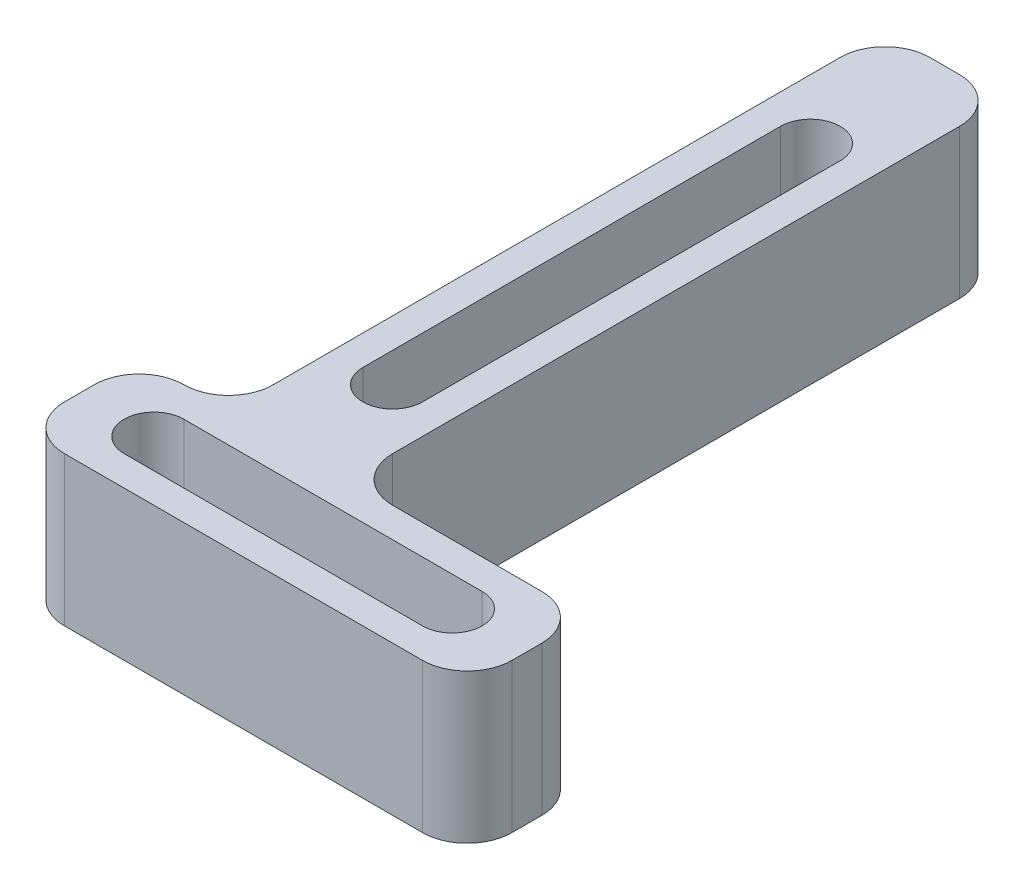
ISO-10303-21;
HEADER;
FILE_DESCRIPTION(('STEP AP214'),'2;1');
FILE_NAME('part.step','',(''),(''),'','','');
FILE_SCHEMA(('AUTOMOTIVE_DESIGN { 1 0 10303 214 1 1 1 1 }'));
ENDSEC;
DATA;
#1=APPLICATION_CONTEXT('core data for automotive mechanical design processes');
#2=APPLICATION_PROTOCOL_DEFINITION('international standard','automotive_design',2000,#1);
#3=PRODUCT_CONTEXT('',#1,'mechanical');
#4=PRODUCT('Part','Part','',(#3));
#5=PRODUCT_RELATED_PRODUCT_CATEGORY('part','',(#4));
#6=PRODUCT_DEFINITION_FORMATION('','',#4);
#7=PRODUCT_DEFINITION_CONTEXT('part definition',#1,'design');
#8=PRODUCT_DEFINITION('design','',#6,#7);
#9=PRODUCT_DEFINITION_SHAPE('','',#8);
#10=(LENGTH_UNIT() NAMED_UNIT(*) SI_UNIT(.MILLI.,.METRE.));
#11=(NAMED_UNIT(*) PLANE_ANGLE_UNIT() SI_UNIT($,.RADIAN.));
#12=(NAMED_UNIT(*) SI_UNIT($,.STERADIAN.) SOLID_ANGLE_UNIT());
#13=UNCERTAINTY_MEASURE_WITH_UNIT(LENGTH_MEASURE(1.E-05),#10,'distance_accuracy_value','');
#14=(GEOMETRIC_REPRESENTATION_CONTEXT(3) GLOBAL_UNCERTAINTY_ASSIGNED_CONTEXT((#13)) GLOBAL_UNIT_ASSIGNED_CONTEXT((#10,
#11,#12)) REPRESENTATION_CONTEXT('',''));
#15=CARTESIAN_POINT('',(0.,0.,0.));
#16=DIRECTION('',(0.,0.,1.));
#17=DIRECTION('',(1.,0.,0.));
#18=AXIS2_PLACEMENT_3D('',#15,#16,#17);
#19=CARTESIAN_POINT('',(-8.,20.,44.));
#20=DIRECTION('',(1.,0.,0.));
#21=DIRECTION('',(0.,0.,-1.));
#22=AXIS2_PLACEMENT_3D('',#19,#20,#21);
#23=PLANE('',#22);
#24=DIRECTION('',(0.,0.,1.));
#25=VECTOR('',#24,1.);
#26=CARTESIAN_POINT('',(-8.,20.,44.));
#27=LINE('',#26,#25);
#28=CARTESIAN_POINT('',(-8.,20.,-38.));
#29=VERTEX_POINT('',#28);
#30=CARTESIAN_POINT('',(-8.,20.,38.));
#31=VERTEX_POINT('',#30);
#32=EDGE_CURVE('E271',#29,#31,#27,.T.);
#33=ORIENTED_EDGE('',*,*,#32,.T.);
#34=DIRECTION('',(0.,1.,0.));
#35=VECTOR('',#34,1.);
#36=CARTESIAN_POINT('',(-8.,20.,38.));
#37=LINE('',#36,#35);
#38=CARTESIAN_POINT('',(-8.,40.,38.));
#39=VERTEX_POINT('',#38);
#40=EDGE_CURVE('E385',#39,#31,#37,.F.);
#41=ORIENTED_EDGE('',*,*,#40,.F.);
#42=DIRECTION('',(0.,0.,1.));
#43=VECTOR('',#42,1.);
#44=CARTESIAN_POINT('',(-8.,40.,44.));
#45=LINE('',#44,#43);
#46=CARTESIAN_POINT('',(-8.,40.,-38.));
#47=VERTEX_POINT('',#46);
#48=EDGE_CURVE('E267',#47,#39,#45,.T.);
#49=ORIENTED_EDGE('',*,*,#48,.F.);
#50=DIRECTION('',(0.,1.,0.));
#51=VECTOR('',#50,1.);
#52=CARTESIAN_POINT('',(-8.,20.,-38.));
#53=LINE('',#52,#51);
#54=EDGE_CURVE('E388',#29,#47,#53,.T.);
#55=ORIENTED_EDGE('',*,*,#54,.F.);
#56=EDGE_LOOP('',(#33,#41,#49,#55));
#57=FACE_BOUND('',#56,.T.);
#58=ADVANCED_FACE('F39',(#57),#23,.F.);
#59=CARTESIAN_POINT('',(-20.,20.,60.));
#60=DIRECTION('',(1.,0.,0.));
#61=DIRECTION('',(0.,0.,-1.));
#62=AXIS2_PLACEMENT_3D('',#59,#60,#61);
#63=PLANE('',#62);
#64=DIRECTION('',(0.,0.,1.));
#65=VECTOR('',#64,1.);
#66=CARTESIAN_POINT('',(-20.,40.,60.));
#67=LINE('',#66,#65);
#68=CARTESIAN_POINT('',(-20.,40.,50.));
#69=VERTEX_POINT('',#68);
#70=CARTESIAN_POINT('',(-20.,40.,54.));
#71=VERTEX_POINT('',#70);
#72=EDGE_CURVE('E296',#69,#71,#67,.T.);
#73=ORIENTED_EDGE('',*,*,#72,.F.);
#74=DIRECTION('',(0.,1.,0.));
#75=VECTOR('',#74,1.);
#76=CARTESIAN_POINT('',(-20.,20.,50.));
#77=LINE('',#76,#75);
#78=CARTESIAN_POINT('',(-20.,20.,50.));
#79=VERTEX_POINT('',#78);
#80=EDGE_CURVE('E361',#79,#69,#77,.T.);
#81=ORIENTED_EDGE('',*,*,#80,.F.);
#82=DIRECTION('',(0.,0.,1.));
#83=VECTOR('',#82,1.);
#84=CARTESIAN_POINT('',(-20.,20.,60.));
#85=LINE('',#84,#83);
#86=CARTESIAN_POINT('',(-20.,20.,54.));
#87=VERTEX_POINT('',#86);
#88=EDGE_CURVE('E274',#79,#87,#85,.T.);
#89=ORIENTED_EDGE('',*,*,#88,.T.);
#90=DIRECTION('',(0.,1.,0.));
#91=VECTOR('',#90,1.);
#92=CARTESIAN_POINT('',(-20.,20.,54.));
#93=LINE('',#92,#91);
#94=EDGE_CURVE('E364',#71,#87,#93,.F.);
#95=ORIENTED_EDGE('',*,*,#94,.F.);
#96=EDGE_LOOP('',(#73,#81,#89,#95));
#97=FACE_BOUND('',#96,.T.);
#98=ADVANCED_FACE('F415',(#97),#63,.F.);
#99=CARTESIAN_POINT('',(40.,20.,60.));
#100=DIRECTION('',(0.,0.,-1.));
#101=DIRECTION('',(-1.,0.,0.));
#102=AXIS2_PLACEMENT_3D('',#99,#100,#101);
#103=PLANE('',#102);
#104=DIRECTION('',(1.,0.,0.));
#105=VECTOR('',#104,1.);
#106=CARTESIAN_POINT('',(40.,40.,60.));
#107=LINE('',#106,#105);
#108=CARTESIAN_POINT('',(-14.,40.,60.));
#109=VERTEX_POINT('',#108);
#110=CARTESIAN_POINT('',(34.,40.,60.));
#111=VERTEX_POINT('',#110);
#112=EDGE_CURVE('E299',#109,#111,#107,.T.);
#113=ORIENTED_EDGE('',*,*,#112,.F.);
#114=DIRECTION('',(0.,1.,0.));
#115=VECTOR('',#114,1.);
#116=CARTESIAN_POINT('',(-14.,20.,60.));
#117=LINE('',#116,#115);
#118=CARTESIAN_POINT('',(-14.,20.,60.));
#119=VERTEX_POINT('',#118);
#120=EDGE_CURVE('E343',#119,#109,#117,.T.);
#121=ORIENTED_EDGE('',*,*,#120,.F.);
#122=DIRECTION('',(1.,0.,0.));
#123=VECTOR('',#122,1.);
#124=CARTESIAN_POINT('',(40.,20.,60.));
#125=LINE('',#124,#123);
#126=CARTESIAN_POINT('',(34.,20.,60.));
#127=VERTEX_POINT('',#126);
#128=EDGE_CURVE('E278',#119,#127,#125,.T.);
#129=ORIENTED_EDGE('',*,*,#128,.T.);
#130=DIRECTION('',(0.,1.,0.));
#131=VECTOR('',#130,1.);
#132=CARTESIAN_POINT('',(34.,20.,60.));
#133=LINE('',#132,#131);
#134=EDGE_CURVE('E346',#111,#127,#133,.F.);
#135=ORIENTED_EDGE('',*,*,#134,.F.);
#136=EDGE_LOOP('',(#113,#121,#129,#135));
#137=FACE_BOUND('',#136,.T.);
#138=ADVANCED_FACE('F422',(#137),#103,.F.);
#139=CARTESIAN_POINT('',(40.,20.,44.));
#140=DIRECTION('',(-1.,0.,0.));
#141=DIRECTION('',(0.,0.,1.));
#142=AXIS2_PLACEMENT_3D('',#139,#140,#141);
#143=PLANE('',#142);
#144=DIRECTION('',(0.,0.,-1.));
#145=VECTOR('',#144,1.);
#146=CARTESIAN_POINT('',(40.,20.,44.));
#147=LINE('',#146,#145);
#148=CARTESIAN_POINT('',(40.,20.,54.));
#149=VERTEX_POINT('',#148);
#150=CARTESIAN_POINT('',(40.,20.,50.));
#151=VERTEX_POINT('',#150);
#152=EDGE_CURVE('E281',#149,#151,#147,.T.);
#153=ORIENTED_EDGE('',*,*,#152,.T.);
#154=DIRECTION('',(0.,1.,0.));
#155=VECTOR('',#154,1.);
#156=CARTESIAN_POINT('',(40.,20.,50.));
#157=LINE('',#156,#155);
#158=CARTESIAN_POINT('',(40.,40.,50.));
#159=VERTEX_POINT('',#158);
#160=EDGE_CURVE('E324',#159,#151,#157,.F.);
#161=ORIENTED_EDGE('',*,*,#160,.F.);
#162=DIRECTION('',(0.,0.,-1.));
#163=VECTOR('',#162,1.);
#164=CARTESIAN_POINT('',(40.,40.,44.));
#165=LINE('',#164,#163);
#166=CARTESIAN_POINT('',(40.,40.,54.));
#167=VERTEX_POINT('',#166);
#168=EDGE_CURVE('E302',#167,#159,#165,.T.);
#169=ORIENTED_EDGE('',*,*,#168,.F.);
#170=DIRECTION('',(0.,1.,0.));
#171=VECTOR('',#170,1.);
#172=CARTESIAN_POINT('',(40.,20.,54.));
#173=LINE('',#172,#171);
#174=EDGE_CURVE('E327',#149,#167,#173,.T.);
#175=ORIENTED_EDGE('',*,*,#174,.F.);
#176=EDGE_LOOP('',(#153,#161,#169,#175));
#177=FACE_BOUND('',#176,.T.);
#178=ADVANCED_FACE('F430',(#177),#143,.F.);
#179=CARTESIAN_POINT('',(8.,20.,44.));
#180=DIRECTION('',(0.,0.,1.));
#181=DIRECTION('',(1.,0.,0.));
#182=AXIS2_PLACEMENT_3D('',#179,#180,#181);
#183=PLANE('',#182);
#184=DIRECTION('',(-1.,0.,0.));
#185=VECTOR('',#184,1.);
#186=CARTESIAN_POINT('',(8.,20.,44.));
#187=LINE('',#186,#185);
#188=CARTESIAN_POINT('',(34.,20.,44.));
#189=VERTEX_POINT('',#188);
#190=CARTESIAN_POINT('',(14.,20.,44.));
#191=VERTEX_POINT('',#190);
#192=EDGE_CURVE('E284',#189,#191,#187,.T.);
#193=ORIENTED_EDGE('',*,*,#192,.T.);
#194=DIRECTION('',(0.,1.,0.));
#195=VECTOR('',#194,1.);
#196=CARTESIAN_POINT('',(14.,20.,44.));
#197=LINE('',#196,#195);
#198=CARTESIAN_POINT('',(14.,40.,44.));
#199=VERTEX_POINT('',#198);
#200=EDGE_CURVE('E367',#199,#191,#197,.F.);
#201=ORIENTED_EDGE('',*,*,#200,.F.);
#202=DIRECTION('',(-1.,0.,0.));
#203=VECTOR('',#202,1.);
#204=CARTESIAN_POINT('',(8.,40.,44.));
#205=LINE('',#204,#203);
#206=CARTESIAN_POINT('',(34.,40.,44.));
#207=VERTEX_POINT('',#206);
#208=EDGE_CURVE('E305',#207,#199,#205,.T.);
#209=ORIENTED_EDGE('',*,*,#208,.F.);
#210=DIRECTION('',(0.,1.,0.));
#211=VECTOR('',#210,1.);
#212=CARTESIAN_POINT('',(34.,20.,44.));
#213=LINE('',#212,#211);
#214=EDGE_CURVE('E370',#189,#207,#213,.T.);
#215=ORIENTED_EDGE('',*,*,#214,.F.);
#216=EDGE_LOOP('',(#193,#201,#209,#215));
#217=FACE_BOUND('',#216,.T.);
#218=ADVANCED_FACE('F437',(#217),#183,.F.);
#219=CARTESIAN_POINT('',(8.,20.,-44.));
#220=DIRECTION('',(-1.,0.,0.));
#221=DIRECTION('',(0.,0.,1.));
#222=AXIS2_PLACEMENT_3D('',#219,#220,#221);
#223=PLANE('',#222);
#224=DIRECTION('',(0.,0.,-1.));
#225=VECTOR('',#224,1.);
#226=CARTESIAN_POINT('',(8.,20.,-44.));
#227=LINE('',#226,#225);
#228=CARTESIAN_POINT('',(8.,20.,38.));
#229=VERTEX_POINT('',#228);
#230=CARTESIAN_POINT('',(8.,20.,-38.));
#231=VERTEX_POINT('',#230);
#232=EDGE_CURVE('E287',#229,#231,#227,.T.);
#233=ORIENTED_EDGE('',*,*,#232,.T.);
#234=DIRECTION('',(0.,1.,0.));
#235=VECTOR('',#234,1.);
#236=CARTESIAN_POINT('',(8.,20.,-38.));
#237=LINE('',#236,#235);
#238=CARTESIAN_POINT('',(8.,40.,-38.));
#239=VERTEX_POINT('',#238);
#240=EDGE_CURVE('E373',#239,#231,#237,.F.);
#241=ORIENTED_EDGE('',*,*,#240,.F.);
#242=DIRECTION('',(0.,0.,-1.));
#243=VECTOR('',#242,1.);
#244=CARTESIAN_POINT('',(8.,40.,-44.));
#245=LINE('',#244,#243);
#246=CARTESIAN_POINT('',(8.,40.,38.));
#247=VERTEX_POINT('',#246);
#248=EDGE_CURVE('E308',#247,#239,#245,.T.);
#249=ORIENTED_EDGE('',*,*,#248,.F.);
#250=DIRECTION('',(0.,1.,0.));
#251=VECTOR('',#250,1.);
#252=CARTESIAN_POINT('',(8.,40.,38.));
#253=LINE('',#252,#251);
#254=EDGE_CURVE('E376',#229,#247,#253,.T.);
#255=ORIENTED_EDGE('',*,*,#254,.F.);
#256=EDGE_LOOP('',(#233,#241,#249,#255));
#257=FACE_BOUND('',#256,.T.);
#258=ADVANCED_FACE('F446',(#257),#223,.F.);
#259=CARTESIAN_POINT('',(-8.,20.,-44.));
#260=DIRECTION('',(0.,0.,1.));
#261=DIRECTION('',(1.,0.,0.));
#262=AXIS2_PLACEMENT_3D('',#259,#260,#261);
#263=PLANE('',#262);
#264=DIRECTION('',(-1.,0.,0.));
#265=VECTOR('',#264,1.);
#266=CARTESIAN_POINT('',(-8.,20.,-44.));
#267=LINE('',#266,#265);
#268=CARTESIAN_POINT('',(1.99999999999999,20.,-44.));
#269=VERTEX_POINT('',#268);
#270=CARTESIAN_POINT('',(-2.00000000000001,20.,-44.));
#271=VERTEX_POINT('',#270);
#272=EDGE_CURVE('E290',#269,#271,#267,.T.);
#273=ORIENTED_EDGE('',*,*,#272,.T.);
#274=DIRECTION('',(0.,1.,0.));
#275=VECTOR('',#274,1.);
#276=CARTESIAN_POINT('',(-2.00000000000001,20.,-44.));
#277=LINE('',#276,#275);
#278=CARTESIAN_POINT('',(-2.00000000000001,40.,-44.));
#279=VERTEX_POINT('',#278);
#280=EDGE_CURVE('E379',#279,#271,#277,.F.);
#281=ORIENTED_EDGE('',*,*,#280,.F.);
#282=DIRECTION('',(-1.,0.,0.));
#283=VECTOR('',#282,1.);
#284=CARTESIAN_POINT('',(-8.,40.,-44.));
#285=LINE('',#284,#283);
#286=CARTESIAN_POINT('',(1.99999999999999,40.,-44.));
#287=VERTEX_POINT('',#286);
#288=EDGE_CURVE('E275',#287,#279,#285,.T.);
#289=ORIENTED_EDGE('',*,*,#288,.F.);
#290=DIRECTION('',(0.,1.,0.));
#291=VECTOR('',#290,1.);
#292=CARTESIAN_POINT('',(1.99999999999999,20.,-44.));
#293=LINE('',#292,#291);
#294=EDGE_CURVE('E382',#269,#287,#293,.T.);
#295=ORIENTED_EDGE('',*,*,#294,.F.);
#296=EDGE_LOOP('',(#273,#281,#289,#295));
#297=FACE_BOUND('',#296,.T.);
#298=ADVANCED_FACE('F453',(#297),#263,.F.);
#299=CARTESIAN_POINT('',(0.,20.,0.));
#300=DIRECTION('',(0.,1.,0.));
#301=DIRECTION('',(0.,0.,-1.));
#302=AXIS2_PLACEMENT_3D('',#299,#300,#301);
#303=PLANE('',#302);
#304=DIRECTION('',(1.,0.,0.));
#305=VECTOR('',#304,1.);
#306=CARTESIAN_POINT('',(-10.,20.,56.));
#307=LINE('',#306,#305);
#308=CARTESIAN_POINT('',(-10.,20.,56.));
#309=VERTEX_POINT('',#308);
#310=CARTESIAN_POINT('',(30.,20.,56.));
#311=VERTEX_POINT('',#310);
#312=EDGE_CURVE('E201',#309,#311,#307,.T.);
#313=ORIENTED_EDGE('',*,*,#312,.T.);
#314=CARTESIAN_POINT('',(30.,20.,52.));
#315=DIRECTION('',(0.,1.,0.));
#316=DIRECTION('',(0.,0.,1.));
#317=AXIS2_PLACEMENT_3D('',#314,#315,#316);
#318=CIRCLE('',#317,3.99999999999999);
#319=CARTESIAN_POINT('',(30.,20.,48.));
#320=VERTEX_POINT('',#319);
#321=EDGE_CURVE('E218',#311,#320,#318,.T.);
#322=ORIENTED_EDGE('',*,*,#321,.T.);
#323=DIRECTION('',(-1.,0.,0.));
#324=VECTOR('',#323,1.);
#325=CARTESIAN_POINT('',(-10.,20.,48.));
#326=LINE('',#325,#324);
#327=CARTESIAN_POINT('',(-10.,20.,48.));
#328=VERTEX_POINT('',#327);
#329=EDGE_CURVE('E215',#320,#328,#326,.T.);
#330=ORIENTED_EDGE('',*,*,#329,.T.);
#331=CARTESIAN_POINT('',(-10.,20.,52.));
#332=DIRECTION('',(0.,1.,0.));
#333=DIRECTION('',(0.,0.,1.));
#334=AXIS2_PLACEMENT_3D('',#331,#332,#333);
#335=CIRCLE('',#334,3.99999999999999);
#336=EDGE_CURVE('E223',#328,#309,#335,.T.);
#337=ORIENTED_EDGE('',*,*,#336,.T.);
#338=EDGE_LOOP('',(#313,#322,#330,#337));
#339=FACE_BOUND('',#338,.T.);
#340=DIRECTION('',(0.,0.,1.));
#341=VECTOR('',#340,1.);
#342=CARTESIAN_POINT('',(-3.99999999999999,20.,-26.));
#343=LINE('',#342,#341);
#344=CARTESIAN_POINT('',(-3.99999999999999,20.,-26.));
#345=VERTEX_POINT('',#344);
#346=CARTESIAN_POINT('',(-3.99999999999999,20.,30.));
#347=VERTEX_POINT('',#346);
#348=EDGE_CURVE('E249',#345,#347,#343,.T.);
#349=ORIENTED_EDGE('',*,*,#348,.T.);
#350=CARTESIAN_POINT('',(0.,20.,30.));
#351=DIRECTION('',(0.,1.,0.));
#352=DIRECTION('',(0.,0.,1.));
#353=AXIS2_PLACEMENT_3D('',#350,#351,#352);
#354=CIRCLE('',#353,4.);
#355=CARTESIAN_POINT('',(4.00000000000001,20.,30.));
#356=VERTEX_POINT('',#355);
#357=EDGE_CURVE('E252',#347,#356,#354,.T.);
#358=ORIENTED_EDGE('',*,*,#357,.T.);
#359=DIRECTION('',(0.,0.,-1.));
#360=VECTOR('',#359,1.);
#361=CARTESIAN_POINT('',(4.,20.,-26.));
#362=LINE('',#361,#360);
#363=CARTESIAN_POINT('',(4.,20.,-26.));
#364=VERTEX_POINT('',#363);
#365=EDGE_CURVE('E237',#356,#364,#362,.T.);
#366=ORIENTED_EDGE('',*,*,#365,.T.);
#367=CARTESIAN_POINT('',(0.,20.,-26.));
#368=DIRECTION('',(0.,1.,0.));
#369=DIRECTION('',(0.,0.,1.));
#370=AXIS2_PLACEMENT_3D('',#367,#368,#369);
#371=CIRCLE('',#370,4.);
#372=EDGE_CURVE('E229',#364,#345,#371,.T.);
#373=ORIENTED_EDGE('',*,*,#372,.T.);
#374=EDGE_LOOP('',(#349,#358,#366,#373));
#375=FACE_BOUND('',#374,.T.);
#376=CARTESIAN_POINT('',(0.,20.,-36.));
#377=DIRECTION('',(0.,1.,0.));
#378=DIRECTION('',(0.,0.,1.));
#379=AXIS2_PLACEMENT_3D('',#376,#377,#378);
#380=CIRCLE('',#379,4.25000000000001);
#381=CARTESIAN_POINT('',(0.,20.,-31.75));
#382=VERTEX_POINT('',#381);
#383=EDGE_CURVE('E264',#382,#382,#380,.T.);
#384=ORIENTED_EDGE('',*,*,#383,.T.);
#385=EDGE_LOOP('',(#384));
#386=FACE_BOUND('',#385,.T.);
#387=CARTESIAN_POINT('',(0.,20.,40.));
#388=DIRECTION('',(0.,1.,0.));
#389=DIRECTION('',(0.,0.,1.));
#390=AXIS2_PLACEMENT_3D('',#387,#388,#389);
#391=CIRCLE('',#390,4.25);
#392=CARTESIAN_POINT('',(0.,20.,44.25));
#393=VERTEX_POINT('',#392);
#394=EDGE_CURVE('E268',#393,#393,#391,.T.);
#395=ORIENTED_EDGE('',*,*,#394,.T.);
#396=EDGE_LOOP('',(#395));
#397=FACE_BOUND('',#396,.T.);
#398=ORIENTED_EDGE('',*,*,#128,.F.);
#399=CARTESIAN_POINT('',(-14.,20.,54.));
#400=DIRECTION('',(0.,-1.,0.));
#401=DIRECTION('',(0.,0.,-1.));
#402=AXIS2_PLACEMENT_3D('',#399,#400,#401);
#403=CIRCLE('',#402,6.);
#404=EDGE_CURVE('E357',#87,#119,#403,.F.);
#405=ORIENTED_EDGE('',*,*,#404,.F.);
#406=ORIENTED_EDGE('',*,*,#88,.F.);
#407=CARTESIAN_POINT('',(-14.,20.,50.));
#408=DIRECTION('',(0.,-1.,0.));
#409=DIRECTION('',(0.,0.,-1.));
#410=AXIS2_PLACEMENT_3D('',#407,#408,#409);
#411=CIRCLE('',#410,6.);
#412=CARTESIAN_POINT('',(-14.,20.,44.));
#413=VERTEX_POINT('',#412);
#414=EDGE_CURVE('E349',#413,#79,#411,.F.);
#415=ORIENTED_EDGE('',*,*,#414,.F.);
#416=CARTESIAN_POINT('',(-14.,20.,38.));
#417=DIRECTION('',(0.,-1.,0.));
#418=DIRECTION('',(0.,0.,-1.));
#419=AXIS2_PLACEMENT_3D('',#416,#417,#418);
#420=CIRCLE('',#419,6.);
#421=EDGE_CURVE('E11',#31,#413,#420,.T.);
#422=ORIENTED_EDGE('',*,*,#421,.F.);
#423=ORIENTED_EDGE('',*,*,#32,.F.);
#424=CARTESIAN_POINT('',(-2.,20.,-38.));
#425=DIRECTION('',(0.,-1.,0.));
#426=DIRECTION('',(0.,0.,-1.));
#427=AXIS2_PLACEMENT_3D('',#424,#425,#426);
#428=CIRCLE('',#427,6.);
#429=EDGE_CURVE('E351',#271,#29,#428,.F.);
#430=ORIENTED_EDGE('',*,*,#429,.F.);
#431=ORIENTED_EDGE('',*,*,#272,.F.);
#432=CARTESIAN_POINT('',(2.,20.,-38.));
#433=DIRECTION('',(0.,-1.,0.));
#434=DIRECTION('',(0.,0.,-1.));
#435=AXIS2_PLACEMENT_3D('',#432,#433,#434);
#436=CIRCLE('',#435,6.);
#437=EDGE_CURVE('E353',#231,#269,#436,.F.);
#438=ORIENTED_EDGE('',*,*,#437,.F.);
#439=ORIENTED_EDGE('',*,*,#232,.F.);
#440=CARTESIAN_POINT('',(14.,20.,38.));
#441=DIRECTION('',(0.,-1.,0.));
#442=DIRECTION('',(0.,0.,-1.));
#443=AXIS2_PLACEMENT_3D('',#440,#441,#442);
#444=CIRCLE('',#443,6.);
#445=EDGE_CURVE('E393',#191,#229,#444,.T.);
#446=ORIENTED_EDGE('',*,*,#445,.F.);
#447=ORIENTED_EDGE('',*,*,#192,.F.);
#448=CARTESIAN_POINT('',(34.,20.,50.));
#449=DIRECTION('',(0.,-1.,0.));
#450=DIRECTION('',(0.,0.,-1.));
#451=AXIS2_PLACEMENT_3D('',#448,#449,#450);
#452=CIRCLE('',#451,6.);
#453=EDGE_CURVE('E355',#151,#189,#452,.F.);
#454=ORIENTED_EDGE('',*,*,#453,.F.);
#455=ORIENTED_EDGE('',*,*,#152,.F.);
#456=CARTESIAN_POINT('',(34.,20.,54.));
#457=DIRECTION('',(0.,-1.,0.));
#458=DIRECTION('',(0.,0.,-1.));
#459=AXIS2_PLACEMENT_3D('',#456,#457,#458);
#460=CIRCLE('',#459,6.);
#461=EDGE_CURVE('E359',#127,#149,#460,.F.);
#462=ORIENTED_EDGE('',*,*,#461,.F.);
#463=EDGE_LOOP('',(#398,#405,#406,#415,#422,#423,#430,#431,#438,#439,#446,#447,#454,#455,#462));
#464=FACE_BOUND('',#463,.T.);
#465=ADVANCED_FACE('F406',(#339,#375,#386,#397,#464),#303,.F.);
#466=CARTESIAN_POINT('',(0.,40.,0.));
#467=DIRECTION('',(0.,1.,0.));
#468=DIRECTION('',(0.,0.,-1.));
#469=AXIS2_PLACEMENT_3D('',#466,#467,#468);
#470=PLANE('',#469);
#471=CARTESIAN_POINT('',(-10.,40.,52.));
#472=DIRECTION('',(0.,1.,0.));
#473=DIRECTION('',(0.,0.,1.));
#474=AXIS2_PLACEMENT_3D('',#471,#472,#473);
#475=CIRCLE('',#474,3.99999999999999);
#476=CARTESIAN_POINT('',(-10.,40.,48.));
#477=VERTEX_POINT('',#476);
#478=CARTESIAN_POINT('',(-10.,40.,56.));
#479=VERTEX_POINT('',#478);
#480=EDGE_CURVE('E209',#477,#479,#475,.T.);
#481=ORIENTED_EDGE('',*,*,#480,.F.);
#482=DIRECTION('',(-1.,0.,0.));
#483=VECTOR('',#482,1.);
#484=CARTESIAN_POINT('',(-10.,40.,48.));
#485=LINE('',#484,#483);
#486=CARTESIAN_POINT('',(30.,40.,48.));
#487=VERTEX_POINT('',#486);
#488=EDGE_CURVE('E202',#487,#477,#485,.T.);
#489=ORIENTED_EDGE('',*,*,#488,.F.);
#490=CARTESIAN_POINT('',(30.,40.,52.));
#491=DIRECTION('',(0.,1.,0.));
#492=DIRECTION('',(0.,0.,1.));
#493=AXIS2_PLACEMENT_3D('',#490,#491,#492);
#494=CIRCLE('',#493,3.99999999999999);
#495=CARTESIAN_POINT('',(30.,40.,56.));
#496=VERTEX_POINT('',#495);
#497=EDGE_CURVE('E210',#496,#487,#494,.T.);
#498=ORIENTED_EDGE('',*,*,#497,.F.);
#499=DIRECTION('',(1.,0.,0.));
#500=VECTOR('',#499,1.);
#501=CARTESIAN_POINT('',(-10.,40.,56.));
#502=LINE('',#501,#500);
#503=EDGE_CURVE('E198',#479,#496,#502,.T.);
#504=ORIENTED_EDGE('',*,*,#503,.F.);
#505=EDGE_LOOP('',(#481,#489,#498,#504));
#506=FACE_BOUND('',#505,.T.);
#507=CARTESIAN_POINT('',(0.,40.,-26.));
#508=DIRECTION('',(0.,1.,0.));
#509=DIRECTION('',(0.,0.,1.));
#510=AXIS2_PLACEMENT_3D('',#507,#508,#509);
#511=CIRCLE('',#510,4.);
#512=CARTESIAN_POINT('',(4.,40.,-26.));
#513=VERTEX_POINT('',#512);
#514=CARTESIAN_POINT('',(-3.99999999999999,40.,-26.));
#515=VERTEX_POINT('',#514);
#516=EDGE_CURVE('E233',#513,#515,#511,.T.);
#517=ORIENTED_EDGE('',*,*,#516,.F.);
#518=DIRECTION('',(0.,0.,-1.));
#519=VECTOR('',#518,1.);
#520=CARTESIAN_POINT('',(4.,40.,-26.));
#521=LINE('',#520,#519);
#522=CARTESIAN_POINT('',(4.00000000000001,40.,30.));
#523=VERTEX_POINT('',#522);
#524=EDGE_CURVE('E243',#523,#513,#521,.T.);
#525=ORIENTED_EDGE('',*,*,#524,.F.);
#526=CARTESIAN_POINT('',(0.,40.,30.));
#527=DIRECTION('',(0.,1.,0.));
#528=DIRECTION('',(0.,0.,1.));
#529=AXIS2_PLACEMENT_3D('',#526,#527,#528);
#530=CIRCLE('',#529,4.);
#531=CARTESIAN_POINT('',(-3.99999999999999,40.,30.));
#532=VERTEX_POINT('',#531);
#533=EDGE_CURVE('E240',#532,#523,#530,.T.);
#534=ORIENTED_EDGE('',*,*,#533,.F.);
#535=DIRECTION('',(0.,0.,1.));
#536=VECTOR('',#535,1.);
#537=CARTESIAN_POINT('',(-3.99999999999999,40.,-26.));
#538=LINE('',#537,#536);
#539=EDGE_CURVE('E236',#515,#532,#538,.T.);
#540=ORIENTED_EDGE('',*,*,#539,.F.);
#541=EDGE_LOOP('',(#517,#525,#534,#540));
#542=FACE_BOUND('',#541,.T.);
#543=ORIENTED_EDGE('',*,*,#168,.T.);
#544=CARTESIAN_POINT('',(34.,40.,50.));
#545=DIRECTION('',(0.,-1.,0.));
#546=DIRECTION('',(0.,0.,-1.));
#547=AXIS2_PLACEMENT_3D('',#544,#545,#546);
#548=CIRCLE('',#547,6.);
#549=EDGE_CURVE('E337',#207,#159,#548,.T.);
#550=ORIENTED_EDGE('',*,*,#549,.F.);
#551=ORIENTED_EDGE('',*,*,#208,.T.);
#552=CARTESIAN_POINT('',(14.,40.,38.));
#553=DIRECTION('',(0.,-1.,0.));
#554=DIRECTION('',(0.,0.,-1.));
#555=AXIS2_PLACEMENT_3D('',#552,#553,#554);
#556=CIRCLE('',#555,6.);
#557=EDGE_CURVE('E391',#247,#199,#556,.F.);
#558=ORIENTED_EDGE('',*,*,#557,.F.);
#559=ORIENTED_EDGE('',*,*,#248,.T.);
#560=CARTESIAN_POINT('',(2.,40.,-38.));
#561=DIRECTION('',(0.,-1.,0.));
#562=DIRECTION('',(0.,0.,-1.));
#563=AXIS2_PLACEMENT_3D('',#560,#561,#562);
#564=CIRCLE('',#563,6.);
#565=EDGE_CURVE('E335',#287,#239,#564,.T.);
#566=ORIENTED_EDGE('',*,*,#565,.F.);
#567=ORIENTED_EDGE('',*,*,#288,.T.);
#568=CARTESIAN_POINT('',(-2.,40.,-38.));
#569=DIRECTION('',(0.,-1.,0.));
#570=DIRECTION('',(0.,0.,-1.));
#571=AXIS2_PLACEMENT_3D('',#568,#569,#570);
#572=CIRCLE('',#571,6.);
#573=EDGE_CURVE('E333',#47,#279,#572,.T.);
#574=ORIENTED_EDGE('',*,*,#573,.F.);
#575=ORIENTED_EDGE('',*,*,#48,.T.);
#576=CARTESIAN_POINT('',(-14.,40.,38.));
#577=DIRECTION('',(0.,-1.,0.));
#578=DIRECTION('',(0.,0.,-1.));
#579=AXIS2_PLACEMENT_3D('',#576,#577,#578);
#580=CIRCLE('',#579,6.);
#581=CARTESIAN_POINT('',(-14.,40.,44.));
#582=VERTEX_POINT('',#581);
#583=EDGE_CURVE('E48',#582,#39,#580,.F.);
#584=ORIENTED_EDGE('',*,*,#583,.F.);
#585=CARTESIAN_POINT('',(-14.,40.,50.));
#586=DIRECTION('',(0.,-1.,0.));
#587=DIRECTION('',(0.,0.,-1.));
#588=AXIS2_PLACEMENT_3D('',#585,#586,#587);
#589=CIRCLE('',#588,6.);
#590=EDGE_CURVE('E330',#69,#582,#589,.T.);
#591=ORIENTED_EDGE('',*,*,#590,.F.);
#592=ORIENTED_EDGE('',*,*,#72,.T.);
#593=CARTESIAN_POINT('',(-14.,40.,54.));
#594=DIRECTION('',(0.,-1.,0.));
#595=DIRECTION('',(0.,0.,-1.));
#596=AXIS2_PLACEMENT_3D('',#593,#594,#595);
#597=CIRCLE('',#596,6.);
#598=EDGE_CURVE('E339',#109,#71,#597,.T.);
#599=ORIENTED_EDGE('',*,*,#598,.F.);
#600=ORIENTED_EDGE('',*,*,#112,.T.);
#601=CARTESIAN_POINT('',(34.,40.,54.));
#602=DIRECTION('',(0.,-1.,0.));
#603=DIRECTION('',(0.,0.,-1.));
#604=AXIS2_PLACEMENT_3D('',#601,#602,#603);
#605=CIRCLE('',#604,6.);
#606=EDGE_CURVE('E341',#167,#111,#605,.T.);
#607=ORIENTED_EDGE('',*,*,#606,.F.);
#608=EDGE_LOOP('',(#543,#550,#551,#558,#559,#566,#567,#574,#575,#584,#591,#592,#599,#600,#607));
#609=FACE_BOUND('',#608,.T.);
#610=ADVANCED_FACE('F206',(#506,#542,#609),#470,.T.);
#611=CARTESIAN_POINT('',(0.,38.,40.));
#612=DIRECTION('',(0.,-1.,0.));
#613=DIRECTION('',(0.,0.,1.));
#614=AXIS2_PLACEMENT_3D('',#611,#612,#613);
#615=CYLINDRICAL_SURFACE('',#614,4.25);
#616=CARTESIAN_POINT('',(0.,27.9999999999966,40.));
#617=DIRECTION('',(0.,1.,0.));
#618=DIRECTION('',(0.,0.,1.));
#619=AXIS2_PLACEMENT_3D('',#616,#617,#618);
#620=CIRCLE('',#619,4.25);
#621=CARTESIAN_POINT('',(0.,27.9999999999966,44.25));
#622=VERTEX_POINT('',#621);
#623=EDGE_CURVE('E315',#622,#622,#620,.F.);
#624=ORIENTED_EDGE('',*,*,#623,.F.);
#625=EDGE_LOOP('',(#624));
#626=FACE_BOUND('',#625,.T.);
#627=ORIENTED_EDGE('',*,*,#394,.F.);
#628=EDGE_LOOP('',(#627));
#629=FACE_BOUND('',#628,.T.);
#630=ADVANCED_FACE('F628',(#626,#629),#615,.F.);
#631=CARTESIAN_POINT('',(0.,38.,40.));
#632=DIRECTION('',(0.,-1.,0.));
#633=DIRECTION('',(0.,0.,1.));
#634=AXIS2_PLACEMENT_3D('',#631,#632,#633);
#635=PLANE('',#634);
#636=CARTESIAN_POINT('',(0.,38.,40.));
#637=DIRECTION('',(0.,1.,0.));
#638=DIRECTION('',(0.,0.,1.));
#639=AXIS2_PLACEMENT_3D('',#636,#637,#638);
#640=CIRCLE('',#639,3.90079230508237);
#641=CARTESIAN_POINT('',(0.,38.,43.9007923050824));
#642=VERTEX_POINT('',#641);
#643=EDGE_CURVE('E293',#642,#642,#640,.T.);
#644=ORIENTED_EDGE('',*,*,#643,.F.);
#645=EDGE_LOOP('',(#644));
#646=FACE_BOUND('',#645,.T.);
#647=ADVANCED_FACE('F621',(#646),#635,.T.);
#648=CARTESIAN_POINT('',(0.,38.,-36.));
#649=DIRECTION('',(0.,-1.,0.));
#650=DIRECTION('',(0.,0.,1.));
#651=AXIS2_PLACEMENT_3D('',#648,#649,#650);
#652=CYLINDRICAL_SURFACE('',#651,4.25000000000001);
#653=CARTESIAN_POINT('',(0.,27.9999999999965,-36.));
#654=DIRECTION('',(0.,1.,0.));
#655=DIRECTION('',(0.,0.,1.));
#656=AXIS2_PLACEMENT_3D('',#653,#654,#655);
#657=CIRCLE('',#656,4.25000000000001);
#658=CARTESIAN_POINT('',(0.,27.9999999999965,-31.75));
#659=VERTEX_POINT('',#658);
#660=EDGE_CURVE('E321',#659,#659,#657,.F.);
#661=ORIENTED_EDGE('',*,*,#660,.F.);
#662=EDGE_LOOP('',(#661));
#663=FACE_BOUND('',#662,.T.);
#664=ORIENTED_EDGE('',*,*,#383,.F.);
#665=EDGE_LOOP('',(#664));
#666=FACE_BOUND('',#665,.T.);
#667=ADVANCED_FACE('F610',(#663,#666),#652,.F.);
#668=CARTESIAN_POINT('',(0.,38.,-36.));
#669=DIRECTION('',(0.,-1.,0.));
#670=DIRECTION('',(0.,0.,1.));
#671=AXIS2_PLACEMENT_3D('',#668,#669,#670);
#672=PLANE('',#671);
#673=CARTESIAN_POINT('',(0.,38.,-36.));
#674=DIRECTION('',(0.,1.,0.));
#675=DIRECTION('',(0.,0.,1.));
#676=AXIS2_PLACEMENT_3D('',#673,#674,#675);
#677=CIRCLE('',#676,3.90079230508237);
#678=CARTESIAN_POINT('',(0.,38.,-32.0992076949176));
#679=VERTEX_POINT('',#678);
#680=EDGE_CURVE('E318',#679,#679,#677,.T.);
#681=ORIENTED_EDGE('',*,*,#680,.F.);
#682=EDGE_LOOP('',(#681));
#683=FACE_BOUND('',#682,.T.);
#684=ADVANCED_FACE('F475',(#683),#672,.T.);
#685=CARTESIAN_POINT('',(0.,38.,40.));
#686=DIRECTION('',(0.,-1.,0.));
#687=DIRECTION('',(0.,0.,1.));
#688=AXIS2_PLACEMENT_3D('',#685,#686,#687);
#689=CONICAL_SURFACE('',#688,3.90079230508237,0.0349065850398902);
#690=ORIENTED_EDGE('',*,*,#623,.T.);
#691=EDGE_LOOP('',(#690));
#692=FACE_BOUND('',#691,.T.);
#693=ORIENTED_EDGE('',*,*,#643,.T.);
#694=EDGE_LOOP('',(#693));
#695=FACE_BOUND('',#694,.T.);
#696=ADVANCED_FACE('F471',(#692,#695),#689,.F.);
#697=CARTESIAN_POINT('',(0.,38.,-36.));
#698=DIRECTION('',(0.,-1.,0.));
#699=DIRECTION('',(0.,0.,1.));
#700=AXIS2_PLACEMENT_3D('',#697,#698,#699);
#701=CONICAL_SURFACE('',#700,3.90079230508237,0.0349065850398902);
#702=ORIENTED_EDGE('',*,*,#660,.T.);
#703=EDGE_LOOP('',(#702));
#704=FACE_BOUND('',#703,.T.);
#705=ORIENTED_EDGE('',*,*,#680,.T.);
#706=EDGE_LOOP('',(#705));
#707=FACE_BOUND('',#706,.T.);
#708=ADVANCED_FACE('F474',(#704,#707),#701,.F.);
#709=CARTESIAN_POINT('',(34.,20.,54.));
#710=DIRECTION('',(0.,1.,0.));
#711=DIRECTION('',(0.,0.,-1.));
#712=AXIS2_PLACEMENT_3D('',#709,#710,#711);
#713=CYLINDRICAL_SURFACE('',#712,6.);
#714=ORIENTED_EDGE('',*,*,#461,.T.);
#715=ORIENTED_EDGE('',*,*,#174,.T.);
#716=ORIENTED_EDGE('',*,*,#606,.T.);
#717=ORIENTED_EDGE('',*,*,#134,.T.);
#718=EDGE_LOOP('',(#714,#715,#716,#717));
#719=FACE_BOUND('',#718,.T.);
#720=ADVANCED_FACE('F427',(#719),#713,.T.);
#721=CARTESIAN_POINT('',(-14.,20.,54.));
#722=DIRECTION('',(0.,1.,0.));
#723=DIRECTION('',(0.,0.,-1.));
#724=AXIS2_PLACEMENT_3D('',#721,#722,#723);
#725=CYLINDRICAL_SURFACE('',#724,6.);
#726=ORIENTED_EDGE('',*,*,#404,.T.);
#727=ORIENTED_EDGE('',*,*,#120,.T.);
#728=ORIENTED_EDGE('',*,*,#598,.T.);
#729=ORIENTED_EDGE('',*,*,#94,.T.);
#730=EDGE_LOOP('',(#726,#727,#728,#729));
#731=FACE_BOUND('',#730,.T.);
#732=ADVANCED_FACE('F417',(#731),#725,.T.);
#733=CARTESIAN_POINT('',(34.,20.,50.));
#734=DIRECTION('',(0.,1.,0.));
#735=DIRECTION('',(0.,0.,-1.));
#736=AXIS2_PLACEMENT_3D('',#733,#734,#735);
#737=CYLINDRICAL_SURFACE('',#736,6.);
#738=ORIENTED_EDGE('',*,*,#453,.T.);
#739=ORIENTED_EDGE('',*,*,#214,.T.);
#740=ORIENTED_EDGE('',*,*,#549,.T.);
#741=ORIENTED_EDGE('',*,*,#160,.T.);
#742=EDGE_LOOP('',(#738,#739,#740,#741));
#743=FACE_BOUND('',#742,.T.);
#744=ADVANCED_FACE('F432',(#743),#737,.T.);
#745=CARTESIAN_POINT('',(14.,20.,38.));
#746=DIRECTION('',(0.,-1.,0.));
#747=DIRECTION('',(0.,0.,1.));
#748=AXIS2_PLACEMENT_3D('',#745,#746,#747);
#749=CYLINDRICAL_SURFACE('',#748,6.);
#750=ORIENTED_EDGE('',*,*,#445,.T.);
#751=ORIENTED_EDGE('',*,*,#254,.T.);
#752=ORIENTED_EDGE('',*,*,#557,.T.);
#753=ORIENTED_EDGE('',*,*,#200,.T.);
#754=EDGE_LOOP('',(#750,#751,#752,#753));
#755=FACE_BOUND('',#754,.T.);
#756=ADVANCED_FACE('F440',(#755),#749,.F.);
#757=CARTESIAN_POINT('',(2.,20.,-38.));
#758=DIRECTION('',(0.,1.,0.));
#759=DIRECTION('',(0.,0.,-1.));
#760=AXIS2_PLACEMENT_3D('',#757,#758,#759);
#761=CYLINDRICAL_SURFACE('',#760,6.);
#762=ORIENTED_EDGE('',*,*,#437,.T.);
#763=ORIENTED_EDGE('',*,*,#294,.T.);
#764=ORIENTED_EDGE('',*,*,#565,.T.);
#765=ORIENTED_EDGE('',*,*,#240,.T.);
#766=EDGE_LOOP('',(#762,#763,#764,#765));
#767=FACE_BOUND('',#766,.T.);
#768=ADVANCED_FACE('F451',(#767),#761,.T.);
#769=CARTESIAN_POINT('',(-2.,20.,-38.));
#770=DIRECTION('',(0.,1.,0.));
#771=DIRECTION('',(0.,0.,-1.));
#772=AXIS2_PLACEMENT_3D('',#769,#770,#771);
#773=CYLINDRICAL_SURFACE('',#772,6.);
#774=ORIENTED_EDGE('',*,*,#429,.T.);
#775=ORIENTED_EDGE('',*,*,#54,.T.);
#776=ORIENTED_EDGE('',*,*,#573,.T.);
#777=ORIENTED_EDGE('',*,*,#280,.T.);
#778=EDGE_LOOP('',(#774,#775,#776,#777));
#779=FACE_BOUND('',#778,.T.);
#780=ADVANCED_FACE('F455',(#779),#773,.T.);
#781=CARTESIAN_POINT('',(-14.,20.,50.));
#782=DIRECTION('',(0.,1.,0.));
#783=DIRECTION('',(0.,0.,-1.));
#784=AXIS2_PLACEMENT_3D('',#781,#782,#783);
#785=CYLINDRICAL_SURFACE('',#784,6.);
#786=ORIENTED_EDGE('',*,*,#80,.T.);
#787=ORIENTED_EDGE('',*,*,#590,.T.);
#788=DIRECTION('',(0.,1.,0.));
#789=VECTOR('',#788,1.);
#790=CARTESIAN_POINT('',(-14.,20.,44.));
#791=LINE('',#790,#789);
#792=EDGE_CURVE('E43',#582,#413,#791,.F.);
#793=ORIENTED_EDGE('',*,*,#792,.T.);
#794=ORIENTED_EDGE('',*,*,#414,.T.);
#795=EDGE_LOOP('',(#786,#787,#793,#794));
#796=FACE_BOUND('',#795,.T.);
#797=ADVANCED_FACE('F41',(#796),#785,.T.);
#798=CARTESIAN_POINT('',(-14.,20.,38.));
#799=DIRECTION('',(0.,-1.,0.));
#800=DIRECTION('',(0.,0.,1.));
#801=AXIS2_PLACEMENT_3D('',#798,#799,#800);
#802=CYLINDRICAL_SURFACE('',#801,6.);
#803=ORIENTED_EDGE('',*,*,#421,.T.);
#804=ORIENTED_EDGE('',*,*,#792,.F.);
#805=ORIENTED_EDGE('',*,*,#583,.T.);
#806=ORIENTED_EDGE('',*,*,#40,.T.);
#807=EDGE_LOOP('',(#803,#804,#805,#806));
#808=FACE_BOUND('',#807,.T.);
#809=ADVANCED_FACE('F397',(#808),#802,.F.);
#810=CARTESIAN_POINT('',(0.,40.,-26.));
#811=DIRECTION('',(0.,-1.,0.));
#812=DIRECTION('',(0.,0.,1.));
#813=AXIS2_PLACEMENT_3D('',#810,#811,#812);
#814=CYLINDRICAL_SURFACE('',#813,4.);
#815=ORIENTED_EDGE('',*,*,#372,.F.);
#816=DIRECTION('',(0.,-1.,0.));
#817=VECTOR('',#816,1.);
#818=CARTESIAN_POINT('',(4.,40.,-26.));
#819=LINE('',#818,#817);
#820=EDGE_CURVE('E257',#513,#364,#819,.T.);
#821=ORIENTED_EDGE('',*,*,#820,.F.);
#822=ORIENTED_EDGE('',*,*,#516,.T.);
#823=DIRECTION('',(0.,-1.,0.));
#824=VECTOR('',#823,1.);
#825=CARTESIAN_POINT('',(-3.99999999999999,40.,-26.));
#826=LINE('',#825,#824);
#827=EDGE_CURVE('E246',#515,#345,#826,.T.);
#828=ORIENTED_EDGE('',*,*,#827,.T.);
#829=EDGE_LOOP('',(#815,#821,#822,#828));
#830=FACE_BOUND('',#829,.T.);
#831=ADVANCED_FACE('F517',(#830),#814,.F.);
#832=CARTESIAN_POINT('',(4.,40.,-26.));
#833=DIRECTION('',(1.,0.,0.));
#834=DIRECTION('',(0.,0.,-1.));
#835=AXIS2_PLACEMENT_3D('',#832,#833,#834);
#836=PLANE('',#835);
#837=ORIENTED_EDGE('',*,*,#365,.F.);
#838=DIRECTION('',(0.,-1.,0.));
#839=VECTOR('',#838,1.);
#840=CARTESIAN_POINT('',(4.00000000000001,40.,30.));
#841=LINE('',#840,#839);
#842=EDGE_CURVE('E259',#523,#356,#841,.T.);
#843=ORIENTED_EDGE('',*,*,#842,.F.);
#844=ORIENTED_EDGE('',*,*,#524,.T.);
#845=ORIENTED_EDGE('',*,*,#820,.T.);
#846=EDGE_LOOP('',(#837,#843,#844,#845));
#847=FACE_BOUND('',#846,.T.);
#848=ADVANCED_FACE('F526',(#847),#836,.F.);
#849=CARTESIAN_POINT('',(0.,40.,30.));
#850=DIRECTION('',(0.,-1.,0.));
#851=DIRECTION('',(0.,0.,1.));
#852=AXIS2_PLACEMENT_3D('',#849,#850,#851);
#853=CYLINDRICAL_SURFACE('',#852,4.);
#854=ORIENTED_EDGE('',*,*,#357,.F.);
#855=DIRECTION('',(0.,-1.,0.));
#856=VECTOR('',#855,1.);
#857=CARTESIAN_POINT('',(-3.99999999999999,40.,30.));
#858=LINE('',#857,#856);
#859=EDGE_CURVE('E261',#532,#347,#858,.T.);
#860=ORIENTED_EDGE('',*,*,#859,.F.);
#861=ORIENTED_EDGE('',*,*,#533,.T.);
#862=ORIENTED_EDGE('',*,*,#842,.T.);
#863=EDGE_LOOP('',(#854,#860,#861,#862));
#864=FACE_BOUND('',#863,.T.);
#865=ADVANCED_FACE('F537',(#864),#853,.F.);
#866=CARTESIAN_POINT('',(-3.99999999999999,40.,-26.));
#867=DIRECTION('',(-1.,0.,0.));
#868=DIRECTION('',(0.,0.,1.));
#869=AXIS2_PLACEMENT_3D('',#866,#867,#868);
#870=PLANE('',#869);
#871=ORIENTED_EDGE('',*,*,#348,.F.);
#872=ORIENTED_EDGE('',*,*,#827,.F.);
#873=ORIENTED_EDGE('',*,*,#539,.T.);
#874=ORIENTED_EDGE('',*,*,#859,.T.);
#875=EDGE_LOOP('',(#871,#872,#873,#874));
#876=FACE_BOUND('',#875,.T.);
#877=ADVANCED_FACE('F548',(#876),#870,.F.);
#878=CARTESIAN_POINT('',(-10.,40.,52.));
#879=DIRECTION('',(0.,-1.,0.));
#880=DIRECTION('',(0.,0.,1.));
#881=AXIS2_PLACEMENT_3D('',#878,#879,#880);
#882=CYLINDRICAL_SURFACE('',#881,3.99999999999999);
#883=ORIENTED_EDGE('',*,*,#336,.F.);
#884=DIRECTION('',(0.,-1.,0.));
#885=VECTOR('',#884,1.);
#886=CARTESIAN_POINT('',(-10.,40.,48.));
#887=LINE('',#886,#885);
#888=EDGE_CURVE('E213',#477,#328,#887,.T.);
#889=ORIENTED_EDGE('',*,*,#888,.F.);
#890=ORIENTED_EDGE('',*,*,#480,.T.);
#891=DIRECTION('',(0.,-1.,0.));
#892=VECTOR('',#891,1.);
#893=CARTESIAN_POINT('',(-10.,40.,56.));
#894=LINE('',#893,#892);
#895=EDGE_CURVE('E55',#479,#309,#894,.T.);
#896=ORIENTED_EDGE('',*,*,#895,.T.);
#897=EDGE_LOOP('',(#883,#889,#890,#896));
#898=FACE_BOUND('',#897,.T.);
#899=ADVANCED_FACE('F212',(#898),#882,.F.);
#900=CARTESIAN_POINT('',(-10.,40.,48.));
#901=DIRECTION('',(0.,0.,-1.));
#902=DIRECTION('',(-1.,0.,0.));
#903=AXIS2_PLACEMENT_3D('',#900,#901,#902);
#904=PLANE('',#903);
#905=ORIENTED_EDGE('',*,*,#329,.F.);
#906=DIRECTION('',(0.,-1.,0.));
#907=VECTOR('',#906,1.);
#908=CARTESIAN_POINT('',(30.,40.,48.));
#909=LINE('',#908,#907);
#910=EDGE_CURVE('E230',#487,#320,#909,.T.);
#911=ORIENTED_EDGE('',*,*,#910,.F.);
#912=ORIENTED_EDGE('',*,*,#488,.T.);
#913=ORIENTED_EDGE('',*,*,#888,.T.);
#914=EDGE_LOOP('',(#905,#911,#912,#913));
#915=FACE_BOUND('',#914,.T.);
#916=ADVANCED_FACE('F569',(#915),#904,.F.);
#917=CARTESIAN_POINT('',(30.,40.,52.));
#918=DIRECTION('',(0.,-1.,0.));
#919=DIRECTION('',(0.,0.,1.));
#920=AXIS2_PLACEMENT_3D('',#917,#918,#919);
#921=CYLINDRICAL_SURFACE('',#920,3.99999999999999);
#922=ORIENTED_EDGE('',*,*,#321,.F.);
#923=DIRECTION('',(0.,-1.,0.));
#924=VECTOR('',#923,1.);
#925=CARTESIAN_POINT('',(30.,40.,56.));
#926=LINE('',#925,#924);
#927=EDGE_CURVE('E63',#496,#311,#926,.T.);
#928=ORIENTED_EDGE('',*,*,#927,.F.);
#929=ORIENTED_EDGE('',*,*,#497,.T.);
#930=ORIENTED_EDGE('',*,*,#910,.T.);
#931=EDGE_LOOP('',(#922,#928,#929,#930));
#932=FACE_BOUND('',#931,.T.);
#933=ADVANCED_FACE('F579',(#932),#921,.F.);
#934=CARTESIAN_POINT('',(-10.,40.,56.));
#935=DIRECTION('',(0.,0.,1.));
#936=DIRECTION('',(1.,0.,0.));
#937=AXIS2_PLACEMENT_3D('',#934,#935,#936);
#938=PLANE('',#937);
#939=ORIENTED_EDGE('',*,*,#312,.F.);
#940=ORIENTED_EDGE('',*,*,#895,.F.);
#941=ORIENTED_EDGE('',*,*,#503,.T.);
#942=ORIENTED_EDGE('',*,*,#927,.T.);
#943=EDGE_LOOP('',(#939,#940,#941,#942));
#944=FACE_BOUND('',#943,.T.);
#945=ADVANCED_FACE('F197',(#944),#938,.F.);
#946=CLOSED_SHELL('',(#58,#98,#138,#178,#218,#258,#298,#465,#610,#630,#647,#667,#684,#696,#708,
#720,#732,#744,#756,#768,#780,#797,#809,#831,#848,#865,#877,#899,#916,#933,#945));
#947=MANIFOLD_SOLID_BREP('B2',#946);
#948=ADVANCED_BREP_SHAPE_REPRESENTATION('',(#18,#947),#14);
#949=SHAPE_DEFINITION_REPRESENTATION(#9,#948);
ENDSEC;
END-ISO-10303-21;
